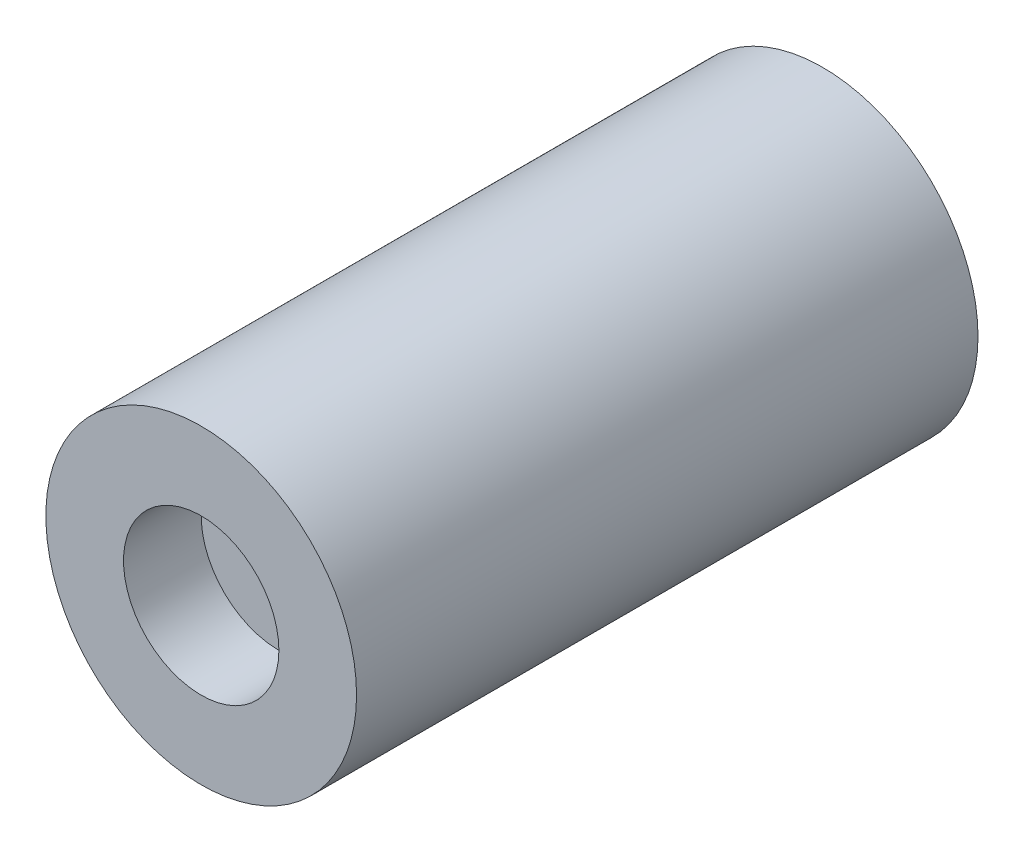
ISO-10303-21;
HEADER;
FILE_DESCRIPTION(('STEP AP214'),'2;1');
FILE_NAME('part.step','',(''),(''),'','','');
FILE_SCHEMA(('AUTOMOTIVE_DESIGN { 1 0 10303 214 1 1 1 1 }'));
ENDSEC;
DATA;
#1=APPLICATION_CONTEXT('core data for automotive mechanical design processes');
#2=APPLICATION_PROTOCOL_DEFINITION('international standard','automotive_design',2000,#1);
#3=PRODUCT_CONTEXT('',#1,'mechanical');
#4=PRODUCT('Part','Part','',(#3));
#5=PRODUCT_RELATED_PRODUCT_CATEGORY('part','',(#4));
#6=PRODUCT_DEFINITION_FORMATION('','',#4);
#7=PRODUCT_DEFINITION_CONTEXT('part definition',#1,'design');
#8=PRODUCT_DEFINITION('design','',#6,#7);
#9=PRODUCT_DEFINITION_SHAPE('','',#8);
#10=(LENGTH_UNIT() NAMED_UNIT(*) SI_UNIT(.MILLI.,.METRE.));
#11=(NAMED_UNIT(*) PLANE_ANGLE_UNIT() SI_UNIT($,.RADIAN.));
#12=(NAMED_UNIT(*) SI_UNIT($,.STERADIAN.) SOLID_ANGLE_UNIT());
#13=UNCERTAINTY_MEASURE_WITH_UNIT(LENGTH_MEASURE(1.E-05),#10,'distance_accuracy_value','');
#14=(GEOMETRIC_REPRESENTATION_CONTEXT(3) GLOBAL_UNCERTAINTY_ASSIGNED_CONTEXT((#13)) GLOBAL_UNIT_ASSIGNED_CONTEXT((#10,
#11,#12)) REPRESENTATION_CONTEXT('',''));
#15=CARTESIAN_POINT('',(0.,0.,0.));
#16=DIRECTION('',(0.,0.,1.));
#17=DIRECTION('',(1.,0.,0.));
#18=AXIS2_PLACEMENT_3D('',#15,#16,#17);
#19=CARTESIAN_POINT('',(0.,0.,40.));
#20=DIRECTION('',(0.,0.,-1.));
#21=DIRECTION('',(-1.,0.,0.));
#22=AXIS2_PLACEMENT_3D('',#19,#20,#21);
#23=CYLINDRICAL_SURFACE('',#22,10.);
#24=CARTESIAN_POINT('',(0.,0.,40.));
#25=DIRECTION('',(0.,0.,1.));
#26=DIRECTION('',(1.,0.,0.));
#27=AXIS2_PLACEMENT_3D('',#24,#25,#26);
#28=CIRCLE('',#27,10.);
#29=CARTESIAN_POINT('',(10.,0.,40.));
#30=VERTEX_POINT('',#29);
#31=EDGE_CURVE('E10',#30,#30,#28,.T.);
#32=ORIENTED_EDGE('',*,*,#31,.F.);
#33=EDGE_LOOP('',(#32));
#34=FACE_BOUND('',#33,.T.);
#35=CARTESIAN_POINT('',(0.,0.,0.));
#36=DIRECTION('',(0.,0.,1.));
#37=DIRECTION('',(1.,0.,0.));
#38=AXIS2_PLACEMENT_3D('',#35,#36,#37);
#39=CIRCLE('',#38,10.);
#40=CARTESIAN_POINT('',(10.,0.,0.));
#41=VERTEX_POINT('',#40);
#42=EDGE_CURVE('E34',#41,#41,#39,.T.);
#43=ORIENTED_EDGE('',*,*,#42,.T.);
#44=EDGE_LOOP('',(#43));
#45=FACE_BOUND('',#44,.T.);
#46=ADVANCED_FACE('F31',(#34,#45),#23,.T.);
#47=CARTESIAN_POINT('',(0.,0.,40.));
#48=DIRECTION('',(0.,0.,1.));
#49=DIRECTION('',(1.,0.,0.));
#50=AXIS2_PLACEMENT_3D('',#47,#48,#49);
#51=PLANE('',#50);
#52=CARTESIAN_POINT('',(0.,0.,40.));
#53=DIRECTION('',(0.,0.,1.));
#54=DIRECTION('',(1.,0.,0.));
#55=AXIS2_PLACEMENT_3D('',#52,#53,#54);
#56=CIRCLE('',#55,5.);
#57=CARTESIAN_POINT('',(5.,0.,40.));
#58=VERTEX_POINT('',#57);
#59=EDGE_CURVE('E43',#58,#58,#56,.T.);
#60=ORIENTED_EDGE('',*,*,#59,.F.);
#61=EDGE_LOOP('',(#60));
#62=FACE_BOUND('',#61,.T.);
#63=ORIENTED_EDGE('',*,*,#31,.T.);
#64=EDGE_LOOP('',(#63));
#65=FACE_BOUND('',#64,.T.);
#66=ADVANCED_FACE('F58',(#62,#65),#51,.T.);
#67=CARTESIAN_POINT('',(0.,0.,0.));
#68=DIRECTION('',(0.,0.,1.));
#69=DIRECTION('',(1.,0.,0.));
#70=AXIS2_PLACEMENT_3D('',#67,#68,#69);
#71=PLANE('',#70);
#72=ORIENTED_EDGE('',*,*,#42,.F.);
#73=EDGE_LOOP('',(#72));
#74=FACE_BOUND('',#73,.T.);
#75=ADVANCED_FACE('F54',(#74),#71,.F.);
#76=CARTESIAN_POINT('',(0.,0.,35.));
#77=DIRECTION('',(0.,0.,1.));
#78=DIRECTION('',(1.,0.,0.));
#79=AXIS2_PLACEMENT_3D('',#76,#77,#78);
#80=CYLINDRICAL_SURFACE('',#79,5.);
#81=CARTESIAN_POINT('',(0.,0.,35.));
#82=DIRECTION('',(0.,0.,1.));
#83=DIRECTION('',(1.,0.,0.));
#84=AXIS2_PLACEMENT_3D('',#81,#82,#83);
#85=CIRCLE('',#84,5.);
#86=CARTESIAN_POINT('',(5.,0.,35.));
#87=VERTEX_POINT('',#86);
#88=EDGE_CURVE('E41',#87,#87,#85,.T.);
#89=ORIENTED_EDGE('',*,*,#88,.F.);
#90=EDGE_LOOP('',(#89));
#91=FACE_BOUND('',#90,.T.);
#92=ORIENTED_EDGE('',*,*,#59,.T.);
#93=EDGE_LOOP('',(#92));
#94=FACE_BOUND('',#93,.T.);
#95=ADVANCED_FACE('F51',(#91,#94),#80,.F.);
#96=CARTESIAN_POINT('',(0.,0.,35.));
#97=DIRECTION('',(0.,0.,1.));
#98=DIRECTION('',(1.,0.,0.));
#99=AXIS2_PLACEMENT_3D('',#96,#97,#98);
#100=PLANE('',#99);
#101=ORIENTED_EDGE('',*,*,#88,.T.);
#102=EDGE_LOOP('',(#101));
#103=FACE_BOUND('',#102,.T.);
#104=ADVANCED_FACE('F49',(#103),#100,.T.);
#105=CLOSED_SHELL('',(#46,#66,#75,#95,#104));
#106=MANIFOLD_SOLID_BREP('B2',#105);
#107=ADVANCED_BREP_SHAPE_REPRESENTATION('',(#18,#106),#14);
#108=SHAPE_DEFINITION_REPRESENTATION(#9,#107);
ENDSEC;
END-ISO-10303-21;
